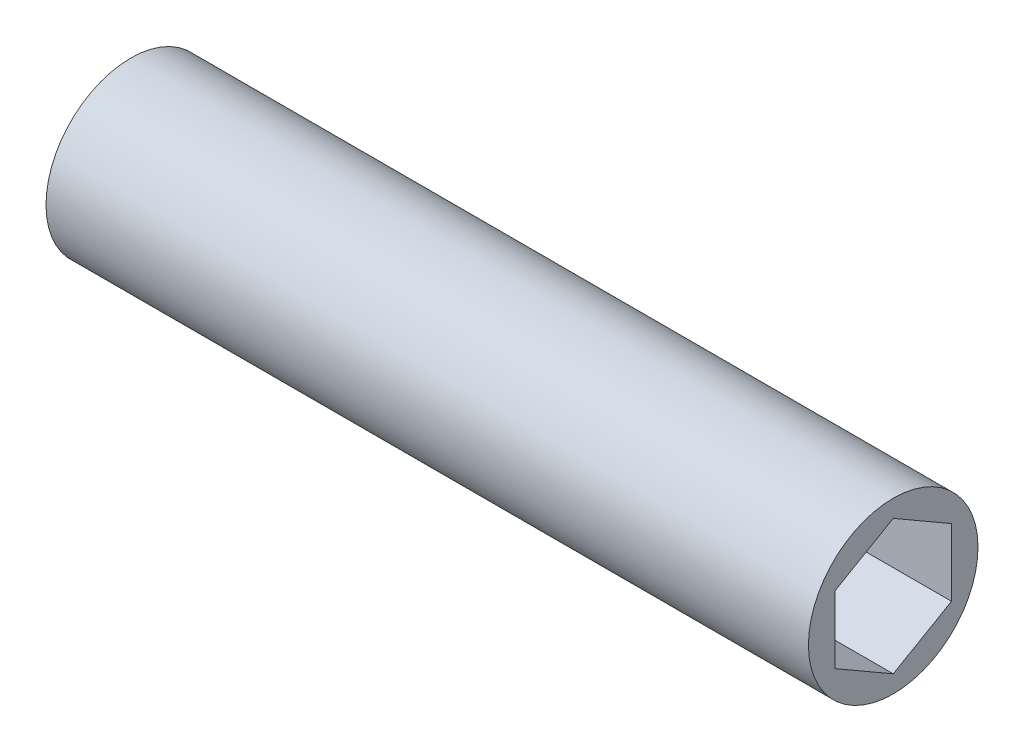
ISO-10303-21;
HEADER;
FILE_DESCRIPTION(('STEP AP214'),'2;1');
FILE_NAME('part.step','',(''),(''),'','','');
FILE_SCHEMA(('AUTOMOTIVE_DESIGN { 1 0 10303 214 1 1 1 1 }'));
ENDSEC;
DATA;
#1=APPLICATION_CONTEXT('core data for automotive mechanical design processes');
#2=APPLICATION_PROTOCOL_DEFINITION('international standard','automotive_design',2000,#1);
#3=PRODUCT_CONTEXT('',#1,'mechanical');
#4=PRODUCT('Part','Part','',(#3));
#5=PRODUCT_RELATED_PRODUCT_CATEGORY('part','',(#4));
#6=PRODUCT_DEFINITION_FORMATION('','',#4);
#7=PRODUCT_DEFINITION_CONTEXT('part definition',#1,'design');
#8=PRODUCT_DEFINITION('design','',#6,#7);
#9=PRODUCT_DEFINITION_SHAPE('','',#8);
#10=(LENGTH_UNIT() NAMED_UNIT(*) SI_UNIT(.MILLI.,.METRE.));
#11=(NAMED_UNIT(*) PLANE_ANGLE_UNIT() SI_UNIT($,.RADIAN.));
#12=(NAMED_UNIT(*) SI_UNIT($,.STERADIAN.) SOLID_ANGLE_UNIT());
#13=UNCERTAINTY_MEASURE_WITH_UNIT(LENGTH_MEASURE(1.E-05),#10,'distance_accuracy_value','');
#14=(GEOMETRIC_REPRESENTATION_CONTEXT(3) GLOBAL_UNCERTAINTY_ASSIGNED_CONTEXT((#13)) GLOBAL_UNIT_ASSIGNED_CONTEXT((#10,
#11,#12)) REPRESENTATION_CONTEXT('',''));
#15=CARTESIAN_POINT('',(0.,0.,0.));
#16=DIRECTION('',(0.,0.,1.));
#17=DIRECTION('',(1.,0.,0.));
#18=AXIS2_PLACEMENT_3D('',#15,#16,#17);
#19=CARTESIAN_POINT('',(85.6615,0.,0.));
#20=DIRECTION('',(1.,0.,0.));
#21=DIRECTION('',(0.,0.,-1.));
#22=AXIS2_PLACEMENT_3D('',#19,#20,#21);
#23=PLANE('',#22);
#24=CARTESIAN_POINT('',(85.6615,0.,0.));
#25=DIRECTION('',(1.,0.,0.));
#26=DIRECTION('',(0.,0.,-1.));
#27=AXIS2_PLACEMENT_3D('',#24,#25,#26);
#28=CIRCLE('',#27,9.525);
#29=CARTESIAN_POINT('',(85.6615,0.,-9.525));
#30=VERTEX_POINT('',#29);
#31=EDGE_CURVE('E11',#30,#30,#28,.T.);
#32=ORIENTED_EDGE('',*,*,#31,.T.);
#33=EDGE_LOOP('',(#32));
#34=FACE_BOUND('',#33,.T.);
#35=DIRECTION('',(0.,-0.5,0.866025403784439));
#36=VECTOR('',#35,1.);
#37=CARTESIAN_POINT('',(85.6615,7.56148430679288,0.));
#38=LINE('',#37,#36);
#39=CARTESIAN_POINT('',(85.6615,7.56148430679288,0.));
#40=VERTEX_POINT('',#39);
#41=CARTESIAN_POINT('',(85.6615,3.78074215339644,6.5484375));
#42=VERTEX_POINT('',#41);
#43=EDGE_CURVE('E102',#40,#42,#38,.T.);
#44=ORIENTED_EDGE('',*,*,#43,.F.);
#45=DIRECTION('',(0.,0.5,0.866025403784439));
#46=VECTOR('',#45,1.);
#47=CARTESIAN_POINT('',(85.6615,3.78074215339644,-6.54843749999999));
#48=LINE('',#47,#46);
#49=CARTESIAN_POINT('',(85.6615,3.78074215339644,-6.54843749999999));
#50=VERTEX_POINT('',#49);
#51=EDGE_CURVE('E93',#50,#40,#48,.T.);
#52=ORIENTED_EDGE('',*,*,#51,.F.);
#53=DIRECTION('',(0.,1.,0.));
#54=VECTOR('',#53,1.);
#55=CARTESIAN_POINT('',(85.6615,-3.78074215339644,-6.5484375));
#56=LINE('',#55,#54);
#57=CARTESIAN_POINT('',(85.6615,-3.78074215339644,-6.5484375));
#58=VERTEX_POINT('',#57);
#59=EDGE_CURVE('E127',#58,#50,#56,.T.);
#60=ORIENTED_EDGE('',*,*,#59,.F.);
#61=DIRECTION('',(0.,0.5,-0.866025403784439));
#62=VECTOR('',#61,1.);
#63=CARTESIAN_POINT('',(85.6615,-7.56148430679288,0.));
#64=LINE('',#63,#62);
#65=CARTESIAN_POINT('',(85.6615,-7.56148430679288,0.));
#66=VERTEX_POINT('',#65);
#67=EDGE_CURVE('E124',#66,#58,#64,.T.);
#68=ORIENTED_EDGE('',*,*,#67,.F.);
#69=DIRECTION('',(0.,-0.5,-0.866025403784438));
#70=VECTOR('',#69,1.);
#71=CARTESIAN_POINT('',(85.6615,-3.78074215339644,6.5484375));
#72=LINE('',#71,#70);
#73=CARTESIAN_POINT('',(85.6615,-3.78074215339644,6.5484375));
#74=VERTEX_POINT('',#73);
#75=EDGE_CURVE('E119',#74,#66,#72,.T.);
#76=ORIENTED_EDGE('',*,*,#75,.F.);
#77=DIRECTION('',(0.,-1.,0.));
#78=VECTOR('',#77,1.);
#79=CARTESIAN_POINT('',(85.6615,3.78074215339644,6.5484375));
#80=LINE('',#79,#78);
#81=EDGE_CURVE('E115',#42,#74,#80,.T.);
#82=ORIENTED_EDGE('',*,*,#81,.F.);
#83=EDGE_LOOP('',(#44,#52,#60,#68,#76,#82));
#84=FACE_BOUND('',#83,.T.);
#85=ADVANCED_FACE('F39',(#34,#84),#23,.T.);
#86=CARTESIAN_POINT('',(0.,0.,0.));
#87=DIRECTION('',(1.,0.,0.));
#88=DIRECTION('',(0.,0.,-1.));
#89=AXIS2_PLACEMENT_3D('',#86,#87,#88);
#90=PLANE('',#89);
#91=CARTESIAN_POINT('',(0.,0.,0.));
#92=DIRECTION('',(1.,0.,0.));
#93=DIRECTION('',(0.,0.,-1.));
#94=AXIS2_PLACEMENT_3D('',#91,#92,#93);
#95=CIRCLE('',#94,9.525);
#96=CARTESIAN_POINT('',(0.,0.,-9.525));
#97=VERTEX_POINT('',#96);
#98=EDGE_CURVE('E43',#97,#97,#95,.T.);
#99=ORIENTED_EDGE('',*,*,#98,.F.);
#100=EDGE_LOOP('',(#99));
#101=FACE_BOUND('',#100,.T.);
#102=DIRECTION('',(0.,0.5,0.866025403784439));
#103=VECTOR('',#102,1.);
#104=CARTESIAN_POINT('',(0.,3.78074215339644,-6.54843749999999));
#105=LINE('',#104,#103);
#106=CARTESIAN_POINT('',(0.,3.78074215339644,-6.54843749999999));
#107=VERTEX_POINT('',#106);
#108=CARTESIAN_POINT('',(0.,7.56148430679288,0.));
#109=VERTEX_POINT('',#108);
#110=EDGE_CURVE('E63',#107,#109,#105,.T.);
#111=ORIENTED_EDGE('',*,*,#110,.T.);
#112=DIRECTION('',(0.,-0.5,0.866025403784439));
#113=VECTOR('',#112,1.);
#114=CARTESIAN_POINT('',(0.,7.56148430679288,0.));
#115=LINE('',#114,#113);
#116=CARTESIAN_POINT('',(0.,3.78074215339644,6.5484375));
#117=VERTEX_POINT('',#116);
#118=EDGE_CURVE('E109',#109,#117,#115,.T.);
#119=ORIENTED_EDGE('',*,*,#118,.T.);
#120=DIRECTION('',(0.,-1.,0.));
#121=VECTOR('',#120,1.);
#122=CARTESIAN_POINT('',(0.,3.78074215339644,6.5484375));
#123=LINE('',#122,#121);
#124=CARTESIAN_POINT('',(0.,-3.78074215339644,6.5484375));
#125=VERTEX_POINT('',#124);
#126=EDGE_CURVE('E134',#117,#125,#123,.T.);
#127=ORIENTED_EDGE('',*,*,#126,.T.);
#128=DIRECTION('',(0.,-0.5,-0.866025403784438));
#129=VECTOR('',#128,1.);
#130=CARTESIAN_POINT('',(0.,-3.78074215339644,6.5484375));
#131=LINE('',#130,#129);
#132=CARTESIAN_POINT('',(0.,-7.56148430679288,0.));
#133=VERTEX_POINT('',#132);
#134=EDGE_CURVE('E138',#125,#133,#131,.T.);
#135=ORIENTED_EDGE('',*,*,#134,.T.);
#136=DIRECTION('',(0.,0.5,-0.866025403784439));
#137=VECTOR('',#136,1.);
#138=CARTESIAN_POINT('',(0.,-7.56148430679288,0.));
#139=LINE('',#138,#137);
#140=CARTESIAN_POINT('',(0.,-3.78074215339644,-6.5484375));
#141=VERTEX_POINT('',#140);
#142=EDGE_CURVE('E142',#133,#141,#139,.T.);
#143=ORIENTED_EDGE('',*,*,#142,.T.);
#144=DIRECTION('',(0.,1.,0.));
#145=VECTOR('',#144,1.);
#146=CARTESIAN_POINT('',(0.,-3.78074215339644,-6.5484375));
#147=LINE('',#146,#145);
#148=EDGE_CURVE('E103',#141,#107,#147,.T.);
#149=ORIENTED_EDGE('',*,*,#148,.T.);
#150=EDGE_LOOP('',(#111,#119,#127,#135,#143,#149));
#151=FACE_BOUND('',#150,.T.);
#152=ADVANCED_FACE('F166',(#101,#151),#90,.F.);
#153=CARTESIAN_POINT('',(85.6615,0.,0.));
#154=DIRECTION('',(-1.,0.,0.));
#155=DIRECTION('',(0.,0.,1.));
#156=AXIS2_PLACEMENT_3D('',#153,#154,#155);
#157=CYLINDRICAL_SURFACE('',#156,9.525);
#158=ORIENTED_EDGE('',*,*,#31,.F.);
#159=EDGE_LOOP('',(#158));
#160=FACE_BOUND('',#159,.T.);
#161=ORIENTED_EDGE('',*,*,#98,.T.);
#162=EDGE_LOOP('',(#161));
#163=FACE_BOUND('',#162,.T.);
#164=ADVANCED_FACE('F41',(#160,#163),#157,.T.);
#165=CARTESIAN_POINT('',(85.6615,3.78074215339644,-6.54843749999999));
#166=DIRECTION('',(0.,-0.866025403784439,0.5));
#167=DIRECTION('',(0.,-0.5,-0.866025403784439));
#168=AXIS2_PLACEMENT_3D('',#165,#166,#167);
#169=PLANE('',#168);
#170=ORIENTED_EDGE('',*,*,#110,.F.);
#171=DIRECTION('',(-1.,0.,0.));
#172=VECTOR('',#171,1.);
#173=CARTESIAN_POINT('',(85.6615,3.78074215339644,-6.54843749999999));
#174=LINE('',#173,#172);
#175=EDGE_CURVE('E97',#50,#107,#174,.T.);
#176=ORIENTED_EDGE('',*,*,#175,.F.);
#177=ORIENTED_EDGE('',*,*,#51,.T.);
#178=DIRECTION('',(-1.,0.,0.));
#179=VECTOR('',#178,1.);
#180=CARTESIAN_POINT('',(85.6615,7.56148430679288,0.));
#181=LINE('',#180,#179);
#182=EDGE_CURVE('E96',#40,#109,#181,.T.);
#183=ORIENTED_EDGE('',*,*,#182,.T.);
#184=EDGE_LOOP('',(#170,#176,#177,#183));
#185=FACE_BOUND('',#184,.T.);
#186=ADVANCED_FACE('F95',(#185),#169,.T.);
#187=CARTESIAN_POINT('',(85.6615,7.56148430679288,0.));
#188=DIRECTION('',(0.,-0.866025403784439,-0.5));
#189=DIRECTION('',(0.,0.5,-0.866025403784439));
#190=AXIS2_PLACEMENT_3D('',#187,#188,#189);
#191=PLANE('',#190);
#192=ORIENTED_EDGE('',*,*,#118,.F.);
#193=ORIENTED_EDGE('',*,*,#182,.F.);
#194=ORIENTED_EDGE('',*,*,#43,.T.);
#195=DIRECTION('',(-1.,0.,0.));
#196=VECTOR('',#195,1.);
#197=CARTESIAN_POINT('',(85.6615,3.78074215339644,6.5484375));
#198=LINE('',#197,#196);
#199=EDGE_CURVE('E111',#42,#117,#198,.T.);
#200=ORIENTED_EDGE('',*,*,#199,.T.);
#201=EDGE_LOOP('',(#192,#193,#194,#200));
#202=FACE_BOUND('',#201,.T.);
#203=ADVANCED_FACE('F106',(#202),#191,.T.);
#204=CARTESIAN_POINT('',(85.6615,3.78074215339644,6.5484375));
#205=DIRECTION('',(0.,0.,-1.));
#206=DIRECTION('',(0.,1.,0.));
#207=AXIS2_PLACEMENT_3D('',#204,#205,#206);
#208=PLANE('',#207);
#209=ORIENTED_EDGE('',*,*,#126,.F.);
#210=ORIENTED_EDGE('',*,*,#199,.F.);
#211=ORIENTED_EDGE('',*,*,#81,.T.);
#212=DIRECTION('',(-1.,0.,0.));
#213=VECTOR('',#212,1.);
#214=CARTESIAN_POINT('',(85.6615,-3.78074215339644,6.5484375));
#215=LINE('',#214,#213);
#216=EDGE_CURVE('E156',#74,#125,#215,.T.);
#217=ORIENTED_EDGE('',*,*,#216,.T.);
#218=EDGE_LOOP('',(#209,#210,#211,#217));
#219=FACE_BOUND('',#218,.T.);
#220=ADVANCED_FACE('F162',(#219),#208,.T.);
#221=CARTESIAN_POINT('',(85.6615,-3.78074215339644,6.5484375));
#222=DIRECTION('',(0.,0.866025403784439,-0.5));
#223=DIRECTION('',(0.,0.5,0.866025403784439));
#224=AXIS2_PLACEMENT_3D('',#221,#222,#223);
#225=PLANE('',#224);
#226=ORIENTED_EDGE('',*,*,#134,.F.);
#227=ORIENTED_EDGE('',*,*,#216,.F.);
#228=ORIENTED_EDGE('',*,*,#75,.T.);
#229=DIRECTION('',(-1.,0.,0.));
#230=VECTOR('',#229,1.);
#231=CARTESIAN_POINT('',(85.6615,-7.56148430679288,0.));
#232=LINE('',#231,#230);
#233=EDGE_CURVE('E153',#66,#133,#232,.T.);
#234=ORIENTED_EDGE('',*,*,#233,.T.);
#235=EDGE_LOOP('',(#226,#227,#228,#234));
#236=FACE_BOUND('',#235,.T.);
#237=ADVANCED_FACE('F174',(#236),#225,.T.);
#238=CARTESIAN_POINT('',(85.6615,-7.56148430679288,0.));
#239=DIRECTION('',(0.,0.866025403784439,0.5));
#240=DIRECTION('',(0.,-0.5,0.866025403784439));
#241=AXIS2_PLACEMENT_3D('',#238,#239,#240);
#242=PLANE('',#241);
#243=ORIENTED_EDGE('',*,*,#142,.F.);
#244=ORIENTED_EDGE('',*,*,#233,.F.);
#245=ORIENTED_EDGE('',*,*,#67,.T.);
#246=DIRECTION('',(-1.,0.,0.));
#247=VECTOR('',#246,1.);
#248=CARTESIAN_POINT('',(85.6615,-3.78074215339644,-6.5484375));
#249=LINE('',#248,#247);
#250=EDGE_CURVE('E55',#58,#141,#249,.T.);
#251=ORIENTED_EDGE('',*,*,#250,.T.);
#252=EDGE_LOOP('',(#243,#244,#245,#251));
#253=FACE_BOUND('',#252,.T.);
#254=ADVANCED_FACE('F172',(#253),#242,.T.);
#255=CARTESIAN_POINT('',(85.6615,-3.78074215339644,-6.5484375));
#256=DIRECTION('',(0.,0.,1.));
#257=DIRECTION('',(0.,-1.,0.));
#258=AXIS2_PLACEMENT_3D('',#255,#256,#257);
#259=PLANE('',#258);
#260=ORIENTED_EDGE('',*,*,#148,.F.);
#261=ORIENTED_EDGE('',*,*,#250,.F.);
#262=ORIENTED_EDGE('',*,*,#59,.T.);
#263=ORIENTED_EDGE('',*,*,#175,.T.);
#264=EDGE_LOOP('',(#260,#261,#262,#263));
#265=FACE_BOUND('',#264,.T.);
#266=ADVANCED_FACE('F168',(#265),#259,.T.);
#267=CLOSED_SHELL('',(#85,#152,#164,#186,#203,#220,#237,#254,#266));
#268=MANIFOLD_SOLID_BREP('B2',#267);
#269=ADVANCED_BREP_SHAPE_REPRESENTATION('',(#18,#268),#14);
#270=SHAPE_DEFINITION_REPRESENTATION(#9,#269);
ENDSEC;
END-ISO-10303-21;
